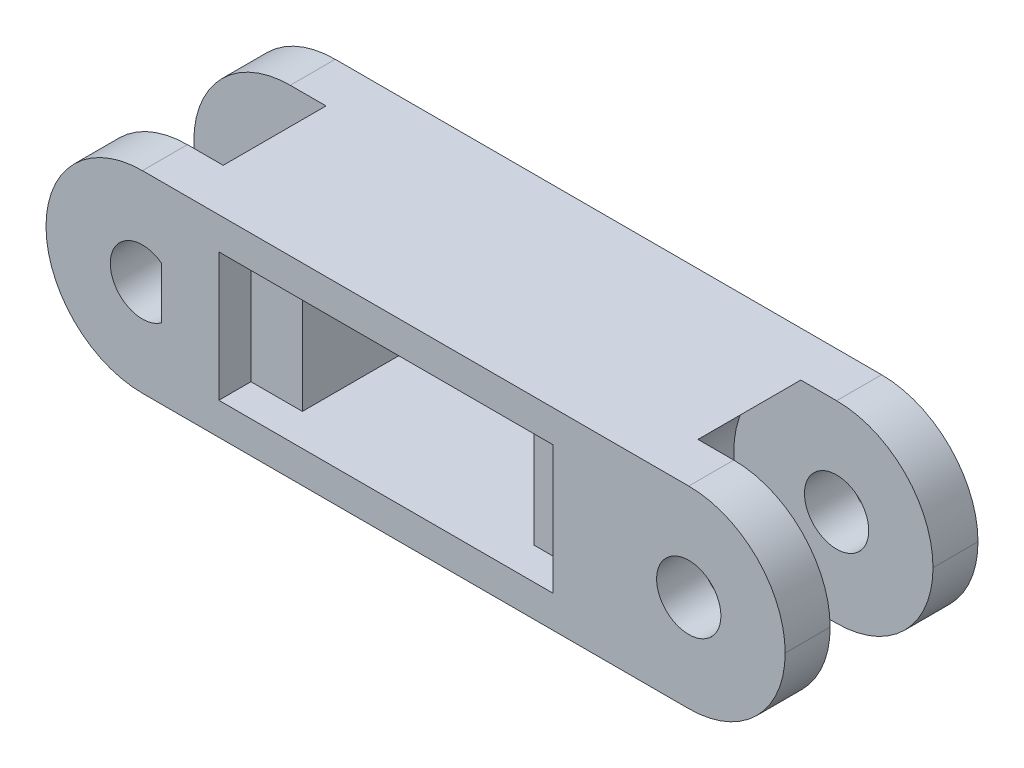
ISO-10303-21;
HEADER;
FILE_DESCRIPTION(('STEP AP214'),'2;1');
FILE_NAME('part.step','',(''),(''),'','','');
FILE_SCHEMA(('AUTOMOTIVE_DESIGN { 1 0 10303 214 1 1 1 1 }'));
ENDSEC;
DATA;
#1=APPLICATION_CONTEXT('core data for automotive mechanical design processes');
#2=APPLICATION_PROTOCOL_DEFINITION('international standard','automotive_design',2000,#1);
#3=PRODUCT_CONTEXT('',#1,'mechanical');
#4=PRODUCT('Part','Part','',(#3));
#5=PRODUCT_RELATED_PRODUCT_CATEGORY('part','',(#4));
#6=PRODUCT_DEFINITION_FORMATION('','',#4);
#7=PRODUCT_DEFINITION_CONTEXT('part definition',#1,'design');
#8=PRODUCT_DEFINITION('design','',#6,#7);
#9=PRODUCT_DEFINITION_SHAPE('','',#8);
#10=(LENGTH_UNIT() NAMED_UNIT(*) SI_UNIT(.MILLI.,.METRE.));
#11=(NAMED_UNIT(*) PLANE_ANGLE_UNIT() SI_UNIT($,.RADIAN.));
#12=(NAMED_UNIT(*) SI_UNIT($,.STERADIAN.) SOLID_ANGLE_UNIT());
#13=UNCERTAINTY_MEASURE_WITH_UNIT(LENGTH_MEASURE(1.E-05),#10,'distance_accuracy_value','');
#14=(GEOMETRIC_REPRESENTATION_CONTEXT(3) GLOBAL_UNCERTAINTY_ASSIGNED_CONTEXT((#13)) GLOBAL_UNIT_ASSIGNED_CONTEXT((#10,
#11,#12)) REPRESENTATION_CONTEXT('',''));
#15=CARTESIAN_POINT('',(0.,0.,0.));
#16=DIRECTION('',(0.,0.,1.));
#17=DIRECTION('',(1.,0.,0.));
#18=AXIS2_PLACEMENT_3D('',#15,#16,#17);
#19=CARTESIAN_POINT('',(-31.75,9.525,9.525));
#20=DIRECTION('',(0.,-1.,0.));
#21=DIRECTION('',(0.,0.,-1.));
#22=AXIS2_PLACEMENT_3D('',#19,#20,#21);
#23=PLANE('',#22);
#24=DIRECTION('',(-1.,0.,0.));
#25=VECTOR('',#24,1.);
#26=CARTESIAN_POINT('',(-31.75,9.525,-5.08));
#27=LINE('',#26,#25);
#28=CARTESIAN_POINT('',(22.225,9.525,-5.08));
#29=VERTEX_POINT('',#28);
#30=CARTESIAN_POINT('',(18.6894696296029,9.525,-5.08));
#31=VERTEX_POINT('',#30);
#32=EDGE_CURVE('E290',#29,#31,#27,.T.);
#33=ORIENTED_EDGE('',*,*,#32,.F.);
#34=DIRECTION('',(0.,0.,-1.));
#35=VECTOR('',#34,1.);
#36=CARTESIAN_POINT('',(22.225,9.525,9.525));
#37=LINE('',#36,#35);
#38=CARTESIAN_POINT('',(22.225,9.525,-9.525));
#39=VERTEX_POINT('',#38);
#40=EDGE_CURVE('E451',#29,#39,#37,.T.);
#41=ORIENTED_EDGE('',*,*,#40,.T.);
#42=DIRECTION('',(-1.,0.,0.));
#43=VECTOR('',#42,1.);
#44=CARTESIAN_POINT('',(-31.75,9.525,-9.525));
#45=LINE('',#44,#43);
#46=CARTESIAN_POINT('',(-31.75,9.525,-9.525));
#47=VERTEX_POINT('',#46);
#48=EDGE_CURVE('E420',#39,#47,#45,.T.);
#49=ORIENTED_EDGE('',*,*,#48,.T.);
#50=DIRECTION('',(0.,0.,-1.));
#51=VECTOR('',#50,1.);
#52=CARTESIAN_POINT('',(-31.75,9.525,9.525));
#53=LINE('',#52,#51);
#54=CARTESIAN_POINT('',(-31.75,9.525,-5.08));
#55=VERTEX_POINT('',#54);
#56=EDGE_CURVE('E432',#55,#47,#53,.T.);
#57=ORIENTED_EDGE('',*,*,#56,.F.);
#58=DIRECTION('',(-1.,0.,0.));
#59=VECTOR('',#58,1.);
#60=CARTESIAN_POINT('',(-31.75,9.525,-5.08));
#61=LINE('',#60,#59);
#62=CARTESIAN_POINT('',(-28.2144696296029,9.525,-5.08));
#63=VERTEX_POINT('',#62);
#64=EDGE_CURVE('E287',#63,#55,#61,.T.);
#65=ORIENTED_EDGE('',*,*,#64,.F.);
#66=DIRECTION('',(0.,0.,1.));
#67=VECTOR('',#66,1.);
#68=CARTESIAN_POINT('',(-28.2144696296029,9.525,-5.08));
#69=LINE('',#68,#67);
#70=CARTESIAN_POINT('',(-28.2144696296029,9.525,5.08));
#71=VERTEX_POINT('',#70);
#72=EDGE_CURVE('E277',#63,#71,#69,.T.);
#73=ORIENTED_EDGE('',*,*,#72,.T.);
#74=DIRECTION('',(-1.,0.,0.));
#75=VECTOR('',#74,1.);
#76=CARTESIAN_POINT('',(-31.75,9.525,5.08));
#77=LINE('',#76,#75);
#78=CARTESIAN_POINT('',(-31.75,9.525,5.08));
#79=VERTEX_POINT('',#78);
#80=EDGE_CURVE('E262',#71,#79,#77,.T.);
#81=ORIENTED_EDGE('',*,*,#80,.T.);
#82=CARTESIAN_POINT('',(-31.75,9.525,9.525));
#83=VERTEX_POINT('',#82);
#84=EDGE_CURVE('E433',#83,#79,#53,.T.);
#85=ORIENTED_EDGE('',*,*,#84,.F.);
#86=DIRECTION('',(-1.,0.,0.));
#87=VECTOR('',#86,1.);
#88=CARTESIAN_POINT('',(-31.75,9.525,9.525));
#89=LINE('',#88,#87);
#90=CARTESIAN_POINT('',(22.225,9.525,9.525));
#91=VERTEX_POINT('',#90);
#92=EDGE_CURVE('E411',#91,#83,#89,.T.);
#93=ORIENTED_EDGE('',*,*,#92,.F.);
#94=CARTESIAN_POINT('',(22.225,9.525,5.08));
#95=VERTEX_POINT('',#94);
#96=EDGE_CURVE('E452',#91,#95,#37,.T.);
#97=ORIENTED_EDGE('',*,*,#96,.T.);
#98=DIRECTION('',(-1.,0.,0.));
#99=VECTOR('',#98,1.);
#100=CARTESIAN_POINT('',(-31.75,9.525,5.08));
#101=LINE('',#100,#99);
#102=CARTESIAN_POINT('',(18.6894696296029,9.525,5.08));
#103=VERTEX_POINT('',#102);
#104=EDGE_CURVE('E491',#95,#103,#101,.T.);
#105=ORIENTED_EDGE('',*,*,#104,.T.);
#106=DIRECTION('',(0.,0.,1.));
#107=VECTOR('',#106,1.);
#108=CARTESIAN_POINT('',(18.6894696296029,9.525,-5.08));
#109=LINE('',#108,#107);
#110=EDGE_CURVE('E289',#103,#31,#109,.F.);
#111=ORIENTED_EDGE('',*,*,#110,.T.);
#112=EDGE_LOOP('',(#33,#41,#49,#57,#65,#73,#81,#85,#93,#97,#105,#111));
#113=FACE_BOUND('',#112,.T.);
#114=ADVANCED_FACE('F46',(#113),#23,.F.);
#115=CARTESIAN_POINT('',(-31.75,-9.525,9.525));
#116=DIRECTION('',(0.,1.,0.));
#117=DIRECTION('',(0.,0.,1.));
#118=AXIS2_PLACEMENT_3D('',#115,#116,#117);
#119=PLANE('',#118);
#120=DIRECTION('',(1.,0.,0.));
#121=VECTOR('',#120,1.);
#122=CARTESIAN_POINT('',(-31.75,-9.525,-5.08));
#123=LINE('',#122,#121);
#124=CARTESIAN_POINT('',(18.6894696296029,-9.525,-5.08));
#125=VERTEX_POINT('',#124);
#126=CARTESIAN_POINT('',(22.225,-9.525,-5.08));
#127=VERTEX_POINT('',#126);
#128=EDGE_CURVE('E297',#125,#127,#123,.T.);
#129=ORIENTED_EDGE('',*,*,#128,.F.);
#130=DIRECTION('',(0.,0.,1.));
#131=VECTOR('',#130,1.);
#132=CARTESIAN_POINT('',(18.6894696296029,-9.525,-5.08));
#133=LINE('',#132,#131);
#134=CARTESIAN_POINT('',(18.6894696296029,-9.525,5.08));
#135=VERTEX_POINT('',#134);
#136=EDGE_CURVE('E12',#125,#135,#133,.T.);
#137=ORIENTED_EDGE('',*,*,#136,.T.);
#138=DIRECTION('',(1.,0.,0.));
#139=VECTOR('',#138,1.);
#140=CARTESIAN_POINT('',(-31.75,-9.525,5.08));
#141=LINE('',#140,#139);
#142=CARTESIAN_POINT('',(22.225,-9.525,5.08));
#143=VERTEX_POINT('',#142);
#144=EDGE_CURVE('E520',#135,#143,#141,.T.);
#145=ORIENTED_EDGE('',*,*,#144,.T.);
#146=DIRECTION('',(0.,0.,-1.));
#147=VECTOR('',#146,1.);
#148=CARTESIAN_POINT('',(22.225,-9.525,9.525));
#149=LINE('',#148,#147);
#150=CARTESIAN_POINT('',(22.225,-9.525,9.525));
#151=VERTEX_POINT('',#150);
#152=EDGE_CURVE('E440',#143,#151,#149,.F.);
#153=ORIENTED_EDGE('',*,*,#152,.T.);
#154=DIRECTION('',(1.,0.,0.));
#155=VECTOR('',#154,1.);
#156=CARTESIAN_POINT('',(-31.75,-9.525,9.525));
#157=LINE('',#156,#155);
#158=CARTESIAN_POINT('',(-31.75,-9.525,9.525));
#159=VERTEX_POINT('',#158);
#160=EDGE_CURVE('E414',#159,#151,#157,.T.);
#161=ORIENTED_EDGE('',*,*,#160,.F.);
#162=DIRECTION('',(0.,0.,-1.));
#163=VECTOR('',#162,1.);
#164=CARTESIAN_POINT('',(-31.75,-9.525,9.525));
#165=LINE('',#164,#163);
#166=CARTESIAN_POINT('',(-31.75,-9.525,5.08));
#167=VERTEX_POINT('',#166);
#168=EDGE_CURVE('E428',#159,#167,#165,.T.);
#169=ORIENTED_EDGE('',*,*,#168,.T.);
#170=DIRECTION('',(1.,0.,0.));
#171=VECTOR('',#170,1.);
#172=CARTESIAN_POINT('',(-31.75,-9.525,5.08));
#173=LINE('',#172,#171);
#174=CARTESIAN_POINT('',(-28.2144696296029,-9.525,5.08));
#175=VERTEX_POINT('',#174);
#176=EDGE_CURVE('E73',#167,#175,#173,.T.);
#177=ORIENTED_EDGE('',*,*,#176,.T.);
#178=DIRECTION('',(0.,0.,1.));
#179=VECTOR('',#178,1.);
#180=CARTESIAN_POINT('',(-28.2144696296029,-9.525,-5.08));
#181=LINE('',#180,#179);
#182=CARTESIAN_POINT('',(-28.2144696296029,-9.525,-5.08));
#183=VERTEX_POINT('',#182);
#184=EDGE_CURVE('E55',#175,#183,#181,.F.);
#185=ORIENTED_EDGE('',*,*,#184,.T.);
#186=DIRECTION('',(1.,0.,0.));
#187=VECTOR('',#186,1.);
#188=CARTESIAN_POINT('',(-31.75,-9.525,-5.08));
#189=LINE('',#188,#187);
#190=CARTESIAN_POINT('',(-31.75,-9.525,-5.08));
#191=VERTEX_POINT('',#190);
#192=EDGE_CURVE('E499',#191,#183,#189,.T.);
#193=ORIENTED_EDGE('',*,*,#192,.F.);
#194=CARTESIAN_POINT('',(-31.75,-9.525,-9.525));
#195=VERTEX_POINT('',#194);
#196=EDGE_CURVE('E419',#191,#195,#165,.T.);
#197=ORIENTED_EDGE('',*,*,#196,.T.);
#198=DIRECTION('',(1.,0.,0.));
#199=VECTOR('',#198,1.);
#200=CARTESIAN_POINT('',(-31.75,-9.525,-9.525));
#201=LINE('',#200,#199);
#202=CARTESIAN_POINT('',(22.225,-9.525,-9.525));
#203=VERTEX_POINT('',#202);
#204=EDGE_CURVE('E415',#195,#203,#201,.T.);
#205=ORIENTED_EDGE('',*,*,#204,.T.);
#206=EDGE_CURVE('E441',#203,#127,#149,.F.);
#207=ORIENTED_EDGE('',*,*,#206,.T.);
#208=EDGE_LOOP('',(#129,#137,#145,#153,#161,#169,#177,#185,#193,#197,#205,#207));
#209=FACE_BOUND('',#208,.T.);
#210=ADVANCED_FACE('F498',(#209),#119,.F.);
#211=CARTESIAN_POINT('',(22.225,0.,9.525));
#212=DIRECTION('',(0.,0.,-1.));
#213=DIRECTION('',(-1.,0.,0.));
#214=AXIS2_PLACEMENT_3D('',#211,#212,#213);
#215=CYLINDRICAL_SURFACE('',#214,9.525);
#216=ORIENTED_EDGE('',*,*,#40,.F.);
#217=CARTESIAN_POINT('',(22.225,0.,-5.08));
#218=DIRECTION('',(0.,0.,1.));
#219=DIRECTION('',(1.,0.,0.));
#220=AXIS2_PLACEMENT_3D('',#217,#218,#219);
#221=CIRCLE('',#220,9.525);
#222=CARTESIAN_POINT('',(31.75,0.,-5.08));
#223=VERTEX_POINT('',#222);
#224=EDGE_CURVE('E528',#29,#223,#221,.F.);
#225=ORIENTED_EDGE('',*,*,#224,.T.);
#226=DIRECTION('',(0.,0.,-1.));
#227=VECTOR('',#226,1.);
#228=CARTESIAN_POINT('',(31.75,0.,9.525));
#229=LINE('',#228,#227);
#230=CARTESIAN_POINT('',(31.75,0.,-9.525));
#231=VERTEX_POINT('',#230);
#232=EDGE_CURVE('E424',#231,#223,#229,.F.);
#233=ORIENTED_EDGE('',*,*,#232,.F.);
#234=CARTESIAN_POINT('',(22.225,0.,-9.525));
#235=DIRECTION('',(0.,0.,-1.));
#236=DIRECTION('',(-1.,0.,0.));
#237=AXIS2_PLACEMENT_3D('',#234,#235,#236);
#238=CIRCLE('',#237,9.525);
#239=EDGE_CURVE('E436',#39,#231,#238,.T.);
#240=ORIENTED_EDGE('',*,*,#239,.F.);
#241=EDGE_LOOP('',(#216,#225,#233,#240));
#242=FACE_BOUND('',#241,.T.);
#243=ADVANCED_FACE('F551',(#242),#215,.T.);
#244=CARTESIAN_POINT('',(22.225,0.,9.525));
#245=DIRECTION('',(0.,0.,-1.));
#246=DIRECTION('',(-1.,0.,0.));
#247=AXIS2_PLACEMENT_3D('',#244,#245,#246);
#248=CYLINDRICAL_SURFACE('',#247,9.525);
#249=ORIENTED_EDGE('',*,*,#232,.T.);
#250=CARTESIAN_POINT('',(22.225,0.,-5.08));
#251=DIRECTION('',(0.,0.,1.));
#252=DIRECTION('',(1.,0.,0.));
#253=AXIS2_PLACEMENT_3D('',#250,#251,#252);
#254=CIRCLE('',#253,9.525);
#255=EDGE_CURVE('E490',#223,#127,#254,.F.);
#256=ORIENTED_EDGE('',*,*,#255,.T.);
#257=ORIENTED_EDGE('',*,*,#206,.F.);
#258=CARTESIAN_POINT('',(22.225,0.,-9.525));
#259=DIRECTION('',(0.,0.,-1.));
#260=DIRECTION('',(-1.,0.,0.));
#261=AXIS2_PLACEMENT_3D('',#258,#259,#260);
#262=CIRCLE('',#261,9.525);
#263=EDGE_CURVE('E438',#231,#203,#262,.T.);
#264=ORIENTED_EDGE('',*,*,#263,.F.);
#265=EDGE_LOOP('',(#249,#256,#257,#264));
#266=FACE_BOUND('',#265,.T.);
#267=ADVANCED_FACE('F537',(#266),#248,.T.);
#268=CARTESIAN_POINT('',(22.225,0.,-9.525));
#269=DIRECTION('',(0.,0.,1.));
#270=DIRECTION('',(1.,0.,0.));
#271=AXIS2_PLACEMENT_3D('',#268,#269,#270);
#272=CYLINDRICAL_SURFACE('',#271,3.175);
#273=CARTESIAN_POINT('',(22.225,0.,-9.525));
#274=DIRECTION('',(0.,0.,1.));
#275=DIRECTION('',(1.,0.,0.));
#276=AXIS2_PLACEMENT_3D('',#273,#274,#275);
#277=CIRCLE('',#276,3.175);
#278=CARTESIAN_POINT('',(25.4,0.,-9.525));
#279=VERTEX_POINT('',#278);
#280=EDGE_CURVE('E404',#279,#279,#277,.T.);
#281=CARTESIAN_POINT('',(22.225,0.,-5.08));
#282=DIRECTION('',(0.,0.,1.));
#283=DIRECTION('',(1.,0.,0.));
#284=AXIS2_PLACEMENT_3D('',#281,#282,#283);
#285=CIRCLE('',#284,3.175);
#286=CARTESIAN_POINT('',(25.4,0.,-5.08));
#287=VERTEX_POINT('',#286);
#288=EDGE_CURVE('E488',#287,#287,#285,.F.);
#289=CARTESIAN_POINT('',(25.4,0.,-9.525));
#290=CARTESIAN_POINT('',(25.4,0.,-9.47869791666667));
#291=CARTESIAN_POINT('',(25.4,0.,-9.43239583333333));
#292=CARTESIAN_POINT('',(25.4,0.,-9.33979166666667));
#293=CARTESIAN_POINT('',(25.4,0.,-9.29348958333333));
#294=CARTESIAN_POINT('',(25.4,0.,-9.20088541666667));
#295=CARTESIAN_POINT('',(25.4,0.,-9.15458333333333));
#296=CARTESIAN_POINT('',(25.4,0.,-9.06197916666667));
#297=CARTESIAN_POINT('',(25.4,0.,-9.01567708333334));
#298=CARTESIAN_POINT('',(25.4,0.,-8.92307291666667));
#299=CARTESIAN_POINT('',(25.4,0.,-8.87677083333333));
#300=CARTESIAN_POINT('',(25.4,0.,-8.78416666666667));
#301=CARTESIAN_POINT('',(25.4,0.,-8.73786458333333));
#302=CARTESIAN_POINT('',(25.4,0.,-8.64526041666667));
#303=CARTESIAN_POINT('',(25.4,0.,-8.59895833333333));
#304=CARTESIAN_POINT('',(25.4,0.,-8.50635416666667));
#305=CARTESIAN_POINT('',(25.4,0.,-8.46005208333333));
#306=CARTESIAN_POINT('',(25.4,0.,-8.36744791666667));
#307=CARTESIAN_POINT('',(25.4,0.,-8.32114583333333));
#308=CARTESIAN_POINT('',(25.4,0.,-8.22854166666667));
#309=CARTESIAN_POINT('',(25.4,0.,-8.18223958333333));
#310=CARTESIAN_POINT('',(25.4,0.,-8.08963541666667));
#311=CARTESIAN_POINT('',(25.4,0.,-8.04333333333333));
#312=CARTESIAN_POINT('',(25.4,0.,-7.95072916666667));
#313=CARTESIAN_POINT('',(25.4,0.,-7.90442708333333));
#314=CARTESIAN_POINT('',(25.4,0.,-7.81182291666667));
#315=CARTESIAN_POINT('',(25.4,0.,-7.76552083333333));
#316=CARTESIAN_POINT('',(25.4,0.,-7.67291666666667));
#317=CARTESIAN_POINT('',(25.4,0.,-7.62661458333333));
#318=CARTESIAN_POINT('',(25.4,0.,-7.53401041666667));
#319=CARTESIAN_POINT('',(25.4,0.,-7.48770833333333));
#320=CARTESIAN_POINT('',(25.4,0.,-7.39510416666667));
#321=CARTESIAN_POINT('',(25.4,0.,-7.34880208333333));
#322=CARTESIAN_POINT('',(25.4,0.,-7.25619791666667));
#323=CARTESIAN_POINT('',(25.4,0.,-7.20989583333333));
#324=CARTESIAN_POINT('',(25.4,0.,-7.11729166666667));
#325=CARTESIAN_POINT('',(25.4,0.,-7.07098958333333));
#326=CARTESIAN_POINT('',(25.4,0.,-6.97838541666667));
#327=CARTESIAN_POINT('',(25.4,0.,-6.93208333333333));
#328=CARTESIAN_POINT('',(25.4,0.,-6.83947916666667));
#329=CARTESIAN_POINT('',(25.4,0.,-6.79317708333333));
#330=CARTESIAN_POINT('',(25.4,0.,-6.70057291666667));
#331=CARTESIAN_POINT('',(25.4,0.,-6.65427083333333));
#332=CARTESIAN_POINT('',(25.4,0.,-6.56166666666667));
#333=CARTESIAN_POINT('',(25.4,0.,-6.51536458333333));
#334=CARTESIAN_POINT('',(25.4,0.,-6.42276041666667));
#335=CARTESIAN_POINT('',(25.4,0.,-6.37645833333333));
#336=CARTESIAN_POINT('',(25.4,0.,-6.28385416666667));
#337=CARTESIAN_POINT('',(25.4,0.,-6.23755208333333));
#338=CARTESIAN_POINT('',(25.4,0.,-6.14494791666667));
#339=CARTESIAN_POINT('',(25.4,0.,-6.09864583333333));
#340=CARTESIAN_POINT('',(25.4,0.,-6.00604166666667));
#341=CARTESIAN_POINT('',(25.4,0.,-5.95973958333333));
#342=CARTESIAN_POINT('',(25.4,0.,-5.86713541666667));
#343=CARTESIAN_POINT('',(25.4,0.,-5.82083333333333));
#344=CARTESIAN_POINT('',(25.4,0.,-5.72822916666667));
#345=CARTESIAN_POINT('',(25.4,0.,-5.68192708333333));
#346=CARTESIAN_POINT('',(25.4,0.,-5.58932291666667));
#347=CARTESIAN_POINT('',(25.4,0.,-5.54302083333333));
#348=CARTESIAN_POINT('',(25.4,0.,-5.45041666666667));
#349=CARTESIAN_POINT('',(25.4,0.,-5.40411458333333));
#350=CARTESIAN_POINT('',(25.4,0.,-5.31151041666667));
#351=CARTESIAN_POINT('',(25.4,0.,-5.26520833333333));
#352=CARTESIAN_POINT('',(25.4,0.,-5.17260416666667));
#353=CARTESIAN_POINT('',(25.4,0.,-5.12630208333333));
#354=CARTESIAN_POINT('',(25.4,0.,-5.08));
#355=B_SPLINE_CURVE_WITH_KNOTS('',3,(#289,#290,#291,#292,#293,#294,#295,#296,#297,#298,#299,
#300,#301,#302,#303,#304,#305,#306,#307,#308,#309,#310,#311,#312,#313,#314,#315,#316,#317,#318,
#319,#320,#321,#322,#323,#324,#325,#326,#327,#328,#329,#330,#331,#332,#333,#334,#335,#336,#337,
#338,#339,#340,#341,#342,#343,#344,#345,#346,#347,#348,#349,#350,#351,#352,#353,#354),
.UNSPECIFIED.,.F.,.F.,(4,2,2,2,2,2,2,2,2,2,2,2,2,2,2,2,2,2,2,2,2,2,2,2,2,2,2,2,2,2,2,2,4),(0.,
0.138906250000001,0.2778125,0.416718750000001,0.555625000000001,0.694531250000002,
0.833437500000001,0.972343750000002,1.11125,1.25015625,1.3890625,1.52796875,1.666875,1.80578125,
1.9446875,2.08359375,2.2225,2.36140625,2.5003125,2.63921875,2.778125,2.91703125,3.0559375,
3.19484375,3.33375,3.47265625,3.6115625,3.75046875,3.889375,4.02828125,4.1671875,4.30609375,
4.445),.UNSPECIFIED.);
#356=EDGE_CURVE('BSEAM632',#279,#287,#355,.T.);
#357=ORIENTED_EDGE('',*,*,#280,.F.);
#358=ORIENTED_EDGE('',*,*,#288,.F.);
#359=ORIENTED_EDGE('',*,*,#356,.T.);
#360=ORIENTED_EDGE('',*,*,#356,.F.);
#361=EDGE_LOOP('',(#357,#359,#358,#360));
#362=FACE_BOUND('',#361,.T.);
#363=ADVANCED_FACE('F632',(#362),#272,.F.);
#364=CARTESIAN_POINT('',(-31.75,0.,-30.8235474856855));
#365=DIRECTION('',(0.,0.,1.));
#366=DIRECTION('',(1.,0.,0.));
#367=AXIS2_PLACEMENT_3D('',#364,#365,#366);
#368=CYLINDRICAL_SURFACE('',#367,9.525);
#369=ORIENTED_EDGE('',*,*,#196,.F.);
#370=CARTESIAN_POINT('',(-31.75,0.,-5.08));
#371=DIRECTION('',(0.,0.,1.));
#372=DIRECTION('',(1.,0.,0.));
#373=AXIS2_PLACEMENT_3D('',#370,#371,#372);
#374=CIRCLE('',#373,9.525);
#375=EDGE_CURVE('E511',#191,#55,#374,.F.);
#376=ORIENTED_EDGE('',*,*,#375,.T.);
#377=ORIENTED_EDGE('',*,*,#56,.T.);
#378=CARTESIAN_POINT('',(-31.75,0.,-9.525));
#379=DIRECTION('',(0.,0.,-1.));
#380=DIRECTION('',(-1.,0.,0.));
#381=AXIS2_PLACEMENT_3D('',#378,#379,#380);
#382=CIRCLE('',#381,9.525);
#383=EDGE_CURVE('E330',#47,#195,#382,.F.);
#384=ORIENTED_EDGE('',*,*,#383,.T.);
#385=EDGE_LOOP('',(#369,#376,#377,#384));
#386=FACE_BOUND('',#385,.T.);
#387=ADVANCED_FACE('F546',(#386),#368,.T.);
#388=CARTESIAN_POINT('',(-31.75,0.,-9.525));
#389=DIRECTION('',(0.,0.,1.));
#390=DIRECTION('',(1.,0.,0.));
#391=AXIS2_PLACEMENT_3D('',#388,#389,#390);
#392=CYLINDRICAL_SURFACE('',#391,3.175);
#393=CARTESIAN_POINT('',(-31.75,0.,-5.08));
#394=DIRECTION('',(0.,0.,1.));
#395=DIRECTION('',(1.,0.,0.));
#396=AXIS2_PLACEMENT_3D('',#393,#394,#395);
#397=CIRCLE('',#396,3.175);
#398=CARTESIAN_POINT('',(-29.845,-2.54,-5.08));
#399=VERTEX_POINT('',#398);
#400=CARTESIAN_POINT('',(-29.845,2.54,-5.08));
#401=VERTEX_POINT('',#400);
#402=EDGE_CURVE('E272',#399,#401,#397,.F.);
#403=ORIENTED_EDGE('',*,*,#402,.F.);
#404=DIRECTION('',(0.,0.,1.));
#405=VECTOR('',#404,1.);
#406=CARTESIAN_POINT('',(-29.845,-2.54,-9.525));
#407=LINE('',#406,#405);
#408=CARTESIAN_POINT('',(-29.845,-2.54,-9.525));
#409=VERTEX_POINT('',#408);
#410=EDGE_CURVE('E323',#409,#399,#407,.T.);
#411=ORIENTED_EDGE('',*,*,#410,.F.);
#412=CARTESIAN_POINT('',(-31.75,0.,-9.525));
#413=DIRECTION('',(0.,0.,1.));
#414=DIRECTION('',(1.,0.,0.));
#415=AXIS2_PLACEMENT_3D('',#412,#413,#414);
#416=CIRCLE('',#415,3.175);
#417=CARTESIAN_POINT('',(-29.845,2.54,-9.525));
#418=VERTEX_POINT('',#417);
#419=EDGE_CURVE('E301',#418,#409,#416,.T.);
#420=ORIENTED_EDGE('',*,*,#419,.F.);
#421=DIRECTION('',(0.,0.,1.));
#422=VECTOR('',#421,1.);
#423=CARTESIAN_POINT('',(-29.845,2.54,-9.525));
#424=LINE('',#423,#422);
#425=EDGE_CURVE('E317',#418,#401,#424,.T.);
#426=ORIENTED_EDGE('',*,*,#425,.T.);
#427=EDGE_LOOP('',(#403,#411,#420,#426));
#428=FACE_BOUND('',#427,.T.);
#429=ADVANCED_FACE('F709',(#428),#392,.F.);
#430=CARTESIAN_POINT('',(-29.845,2.54,-9.525));
#431=DIRECTION('',(1.,0.,0.));
#432=DIRECTION('',(0.,0.,-1.));
#433=AXIS2_PLACEMENT_3D('',#430,#431,#432);
#434=PLANE('',#433);
#435=DIRECTION('',(0.,-1.,0.));
#436=VECTOR('',#435,1.);
#437=CARTESIAN_POINT('',(-29.845,2.54,-5.08));
#438=LINE('',#437,#436);
#439=EDGE_CURVE('E481',#401,#399,#438,.T.);
#440=ORIENTED_EDGE('',*,*,#439,.F.);
#441=ORIENTED_EDGE('',*,*,#425,.F.);
#442=DIRECTION('',(0.,1.,0.));
#443=VECTOR('',#442,1.);
#444=CARTESIAN_POINT('',(-29.845,2.54,-9.525));
#445=LINE('',#444,#443);
#446=EDGE_CURVE('E305',#409,#418,#445,.T.);
#447=ORIENTED_EDGE('',*,*,#446,.F.);
#448=ORIENTED_EDGE('',*,*,#410,.T.);
#449=EDGE_LOOP('',(#440,#441,#447,#448));
#450=FACE_BOUND('',#449,.T.);
#451=ADVANCED_FACE('F721',(#450),#434,.F.);
#452=CARTESIAN_POINT('',(3.73847461367321,-6.35,9.525));
#453=DIRECTION('',(1.,0.,0.));
#454=DIRECTION('',(0.,0.,-1.));
#455=AXIS2_PLACEMENT_3D('',#452,#453,#454);
#456=PLANE('',#455);
#457=DIRECTION('',(0.,-1.,0.));
#458=VECTOR('',#457,1.);
#459=CARTESIAN_POINT('',(3.73847461367321,-6.35,0.));
#460=LINE('',#459,#458);
#461=CARTESIAN_POINT('',(3.73847461367321,6.35,0.));
#462=VERTEX_POINT('',#461);
#463=CARTESIAN_POINT('',(3.73847461367321,-6.35,0.));
#464=VERTEX_POINT('',#463);
#465=EDGE_CURVE('E335',#462,#464,#460,.T.);
#466=ORIENTED_EDGE('',*,*,#465,.T.);
#467=DIRECTION('',(0.,0.,-1.));
#468=VECTOR('',#467,1.);
#469=CARTESIAN_POINT('',(3.73847461367321,-6.35,9.525));
#470=LINE('',#469,#468);
#471=CARTESIAN_POINT('',(3.73847461367321,-6.35,6.35));
#472=VERTEX_POINT('',#471);
#473=EDGE_CURVE('E368',#472,#464,#470,.T.);
#474=ORIENTED_EDGE('',*,*,#473,.F.);
#475=DIRECTION('',(0.,-1.,0.));
#476=VECTOR('',#475,1.);
#477=CARTESIAN_POINT('',(3.73847461367321,0.,6.35));
#478=LINE('',#477,#476);
#479=CARTESIAN_POINT('',(3.73847461367321,6.35,6.35));
#480=VERTEX_POINT('',#479);
#481=EDGE_CURVE('E470',#480,#472,#478,.T.);
#482=ORIENTED_EDGE('',*,*,#481,.F.);
#483=DIRECTION('',(0.,0.,-1.));
#484=VECTOR('',#483,1.);
#485=CARTESIAN_POINT('',(3.73847461367321,6.35,9.525));
#486=LINE('',#485,#484);
#487=EDGE_CURVE('E371',#480,#462,#486,.T.);
#488=ORIENTED_EDGE('',*,*,#487,.T.);
#489=EDGE_LOOP('',(#466,#474,#482,#488));
#490=FACE_BOUND('',#489,.T.);
#491=ADVANCED_FACE('F611',(#490),#456,.F.);
#492=CARTESIAN_POINT('',(0.,0.,6.35));
#493=DIRECTION('',(0.,0.,-1.));
#494=DIRECTION('',(-1.,0.,0.));
#495=AXIS2_PLACEMENT_3D('',#492,#493,#494);
#496=PLANE('',#495);
#497=DIRECTION('',(1.,0.,0.));
#498=VECTOR('',#497,1.);
#499=CARTESIAN_POINT('',(-24.2015253863268,-6.35,6.35));
#500=LINE('',#499,#498);
#501=CARTESIAN_POINT('',(-24.2015253863268,-6.35,6.35));
#502=VERTEX_POINT('',#501);
#503=CARTESIAN_POINT('',(-19.1215253863268,-6.35,6.35));
#504=VERTEX_POINT('',#503);
#505=EDGE_CURVE('E388',#502,#504,#500,.T.);
#506=ORIENTED_EDGE('',*,*,#505,.T.);
#507=DIRECTION('',(0.,1.,0.));
#508=VECTOR('',#507,1.);
#509=CARTESIAN_POINT('',(-19.1215253863268,0.,6.35));
#510=LINE('',#509,#508);
#511=CARTESIAN_POINT('',(-19.1215253863268,6.35,6.35));
#512=VERTEX_POINT('',#511);
#513=EDGE_CURVE('E473',#504,#512,#510,.T.);
#514=ORIENTED_EDGE('',*,*,#513,.T.);
#515=DIRECTION('',(-1.,0.,0.));
#516=VECTOR('',#515,1.);
#517=CARTESIAN_POINT('',(-24.2015253863268,6.35,6.35));
#518=LINE('',#517,#516);
#519=CARTESIAN_POINT('',(-24.2015253863268,6.35,6.35));
#520=VERTEX_POINT('',#519);
#521=EDGE_CURVE('E379',#512,#520,#518,.T.);
#522=ORIENTED_EDGE('',*,*,#521,.T.);
#523=DIRECTION('',(0.,-1.,0.));
#524=VECTOR('',#523,1.);
#525=CARTESIAN_POINT('',(-24.2015253863268,-6.35,6.35));
#526=LINE('',#525,#524);
#527=EDGE_CURVE('E383',#520,#502,#526,.T.);
#528=ORIENTED_EDGE('',*,*,#527,.T.);
#529=EDGE_LOOP('',(#506,#514,#522,#528));
#530=FACE_BOUND('',#529,.T.);
#531=ADVANCED_FACE('F575',(#530),#496,.F.);
#532=CARTESIAN_POINT('',(0.,0.,9.525));
#533=DIRECTION('',(0.,0.,-1.));
#534=DIRECTION('',(-1.,0.,0.));
#535=AXIS2_PLACEMENT_3D('',#532,#533,#534);
#536=PLANE('',#535);
#537=DIRECTION('',(0.,1.,0.));
#538=VECTOR('',#537,1.);
#539=CARTESIAN_POINT('',(-29.845,2.54,9.525));
#540=LINE('',#539,#538);
#541=CARTESIAN_POINT('',(-29.845,-2.54,9.525));
#542=VERTEX_POINT('',#541);
#543=CARTESIAN_POINT('',(-29.845,2.54,9.525));
#544=VERTEX_POINT('',#543);
#545=EDGE_CURVE('E306',#542,#544,#540,.T.);
#546=ORIENTED_EDGE('',*,*,#545,.F.);
#547=CARTESIAN_POINT('',(-31.75,0.,9.525));
#548=DIRECTION('',(0.,0.,1.));
#549=DIRECTION('',(1.,0.,0.));
#550=AXIS2_PLACEMENT_3D('',#547,#548,#549);
#551=CIRCLE('',#550,3.175);
#552=EDGE_CURVE('E295',#544,#542,#551,.T.);
#553=ORIENTED_EDGE('',*,*,#552,.F.);
#554=EDGE_LOOP('',(#546,#553));
#555=FACE_BOUND('',#554,.T.);
#556=ORIENTED_EDGE('',*,*,#160,.T.);
#557=CARTESIAN_POINT('',(22.225,0.,9.525));
#558=DIRECTION('',(0.,0.,-1.));
#559=DIRECTION('',(-1.,0.,0.));
#560=AXIS2_PLACEMENT_3D('',#557,#558,#559);
#561=CIRCLE('',#560,9.525);
#562=CARTESIAN_POINT('',(31.75,0.,9.525));
#563=VERTEX_POINT('',#562);
#564=EDGE_CURVE('E447',#151,#563,#561,.F.);
#565=ORIENTED_EDGE('',*,*,#564,.T.);
#566=CARTESIAN_POINT('',(22.225,0.,9.525));
#567=DIRECTION('',(0.,0.,-1.));
#568=DIRECTION('',(-1.,0.,0.));
#569=AXIS2_PLACEMENT_3D('',#566,#567,#568);
#570=CIRCLE('',#569,9.525);
#571=EDGE_CURVE('E444',#563,#91,#570,.F.);
#572=ORIENTED_EDGE('',*,*,#571,.T.);
#573=ORIENTED_EDGE('',*,*,#92,.T.);
#574=CARTESIAN_POINT('',(-31.75,0.,9.525));
#575=DIRECTION('',(0.,0.,1.));
#576=DIRECTION('',(1.,0.,0.));
#577=AXIS2_PLACEMENT_3D('',#574,#575,#576);
#578=CIRCLE('',#577,9.525);
#579=EDGE_CURVE('E321',#83,#159,#578,.T.);
#580=ORIENTED_EDGE('',*,*,#579,.T.);
#581=EDGE_LOOP('',(#556,#565,#572,#573,#580));
#582=FACE_BOUND('',#581,.T.);
#583=CARTESIAN_POINT('',(22.225,0.,9.525));
#584=DIRECTION('',(0.,0.,-1.));
#585=DIRECTION('',(-1.,0.,0.));
#586=AXIS2_PLACEMENT_3D('',#583,#584,#585);
#587=CIRCLE('',#586,3.175);
#588=CARTESIAN_POINT('',(25.4,0.,9.525));
#589=VERTEX_POINT('',#588);
#590=EDGE_CURVE('E407',#589,#589,#587,.T.);
#591=ORIENTED_EDGE('',*,*,#590,.T.);
#592=EDGE_LOOP('',(#591));
#593=FACE_BOUND('',#592,.T.);
#594=DIRECTION('',(0.,1.,0.));
#595=VECTOR('',#594,1.);
#596=CARTESIAN_POINT('',(8.81847461367321,0.,9.525));
#597=LINE('',#596,#595);
#598=CARTESIAN_POINT('',(8.81847461367321,-6.35,9.525));
#599=VERTEX_POINT('',#598);
#600=CARTESIAN_POINT('',(8.81847461367321,6.35,9.525));
#601=VERTEX_POINT('',#600);
#602=EDGE_CURVE('E467',#599,#601,#597,.T.);
#603=ORIENTED_EDGE('',*,*,#602,.F.);
#604=DIRECTION('',(1.,0.,0.));
#605=VECTOR('',#604,1.);
#606=CARTESIAN_POINT('',(0.,-6.35,9.525));
#607=LINE('',#606,#605);
#608=CARTESIAN_POINT('',(-24.2015253863268,-6.35,9.525));
#609=VERTEX_POINT('',#608);
#610=EDGE_CURVE('E455',#609,#599,#607,.T.);
#611=ORIENTED_EDGE('',*,*,#610,.F.);
#612=DIRECTION('',(0.,-1.,0.));
#613=VECTOR('',#612,1.);
#614=CARTESIAN_POINT('',(-24.2015253863268,0.,9.525));
#615=LINE('',#614,#613);
#616=CARTESIAN_POINT('',(-24.2015253863268,6.35,9.525));
#617=VERTEX_POINT('',#616);
#618=EDGE_CURVE('E460',#617,#609,#615,.T.);
#619=ORIENTED_EDGE('',*,*,#618,.F.);
#620=DIRECTION('',(-1.,0.,0.));
#621=VECTOR('',#620,1.);
#622=CARTESIAN_POINT('',(0.,6.35,9.525));
#623=LINE('',#622,#621);
#624=EDGE_CURVE('E464',#601,#617,#623,.T.);
#625=ORIENTED_EDGE('',*,*,#624,.F.);
#626=EDGE_LOOP('',(#603,#611,#619,#625));
#627=FACE_BOUND('',#626,.T.);
#628=ADVANCED_FACE('F618',(#555,#582,#593,#627),#536,.F.);
#629=CARTESIAN_POINT('',(0.,0.,-9.525));
#630=DIRECTION('',(0.,0.,-1.));
#631=DIRECTION('',(-1.,0.,0.));
#632=AXIS2_PLACEMENT_3D('',#629,#630,#631);
#633=PLANE('',#632);
#634=ORIENTED_EDGE('',*,*,#419,.T.);
#635=ORIENTED_EDGE('',*,*,#446,.T.);
#636=EDGE_LOOP('',(#634,#635));
#637=FACE_BOUND('',#636,.T.);
#638=DIRECTION('',(0.,-1.,0.));
#639=VECTOR('',#638,1.);
#640=CARTESIAN_POINT('',(8.81847461367321,6.35,-9.525));
#641=LINE('',#640,#639);
#642=CARTESIAN_POINT('',(8.81847461367321,6.35,-9.525));
#643=VERTEX_POINT('',#642);
#644=CARTESIAN_POINT('',(8.81847461367321,-6.35,-9.525));
#645=VERTEX_POINT('',#644);
#646=EDGE_CURVE('E334',#643,#645,#641,.T.);
#647=ORIENTED_EDGE('',*,*,#646,.F.);
#648=DIRECTION('',(1.,0.,0.));
#649=VECTOR('',#648,1.);
#650=CARTESIAN_POINT('',(3.73847461367321,6.35,-9.525));
#651=LINE('',#650,#649);
#652=CARTESIAN_POINT('',(-19.1215253863268,6.35,-9.525));
#653=VERTEX_POINT('',#652);
#654=EDGE_CURVE('E357',#653,#643,#651,.T.);
#655=ORIENTED_EDGE('',*,*,#654,.F.);
#656=DIRECTION('',(0.,1.,0.));
#657=VECTOR('',#656,1.);
#658=CARTESIAN_POINT('',(-19.1215253863268,-6.35,-9.525));
#659=LINE('',#658,#657);
#660=CARTESIAN_POINT('',(-19.1215253863268,-6.35,-9.525));
#661=VERTEX_POINT('',#660);
#662=EDGE_CURVE('E354',#661,#653,#659,.T.);
#663=ORIENTED_EDGE('',*,*,#662,.F.);
#664=DIRECTION('',(-1.,0.,0.));
#665=VECTOR('',#664,1.);
#666=CARTESIAN_POINT('',(3.73847461367321,-6.35,-9.525));
#667=LINE('',#666,#665);
#668=EDGE_CURVE('E359',#645,#661,#667,.T.);
#669=ORIENTED_EDGE('',*,*,#668,.F.);
#670=EDGE_LOOP('',(#647,#655,#663,#669));
#671=FACE_BOUND('',#670,.T.);
#672=ORIENTED_EDGE('',*,*,#280,.T.);
#673=EDGE_LOOP('',(#672));
#674=FACE_BOUND('',#673,.T.);
#675=ORIENTED_EDGE('',*,*,#239,.T.);
#676=ORIENTED_EDGE('',*,*,#263,.T.);
#677=ORIENTED_EDGE('',*,*,#204,.F.);
#678=ORIENTED_EDGE('',*,*,#383,.F.);
#679=ORIENTED_EDGE('',*,*,#48,.F.);
#680=EDGE_LOOP('',(#675,#676,#677,#678,#679));
#681=FACE_BOUND('',#680,.T.);
#682=ADVANCED_FACE('F543',(#637,#671,#674,#681),#633,.T.);
#683=CARTESIAN_POINT('',(22.225,0.,5.08));
#684=DIRECTION('',(0.,0.,1.));
#685=DIRECTION('',(1.,0.,0.));
#686=AXIS2_PLACEMENT_3D('',#683,#684,#685);
#687=CIRCLE('',#686,9.525);
#688=CARTESIAN_POINT('',(31.75,0.,5.08));
#689=VERTEX_POINT('',#688);
#690=EDGE_CURVE('E62',#95,#689,#687,.F.);
#691=ORIENTED_EDGE('',*,*,#690,.F.);
#692=ORIENTED_EDGE('',*,*,#96,.F.);
#693=ORIENTED_EDGE('',*,*,#571,.F.);
#694=EDGE_CURVE('E410',#689,#563,#229,.F.);
#695=ORIENTED_EDGE('',*,*,#694,.F.);
#696=EDGE_LOOP('',(#691,#692,#693,#695));
#697=FACE_BOUND('',#696,.T.);
#698=ADVANCED_FACE('F48',(#697),#215,.T.);
#699=CARTESIAN_POINT('',(22.225,0.,5.08));
#700=DIRECTION('',(0.,0.,1.));
#701=DIRECTION('',(1.,0.,0.));
#702=AXIS2_PLACEMENT_3D('',#699,#700,#701);
#703=CIRCLE('',#702,9.525);
#704=EDGE_CURVE('E487',#689,#143,#703,.F.);
#705=ORIENTED_EDGE('',*,*,#704,.F.);
#706=ORIENTED_EDGE('',*,*,#694,.T.);
#707=ORIENTED_EDGE('',*,*,#564,.F.);
#708=ORIENTED_EDGE('',*,*,#152,.F.);
#709=EDGE_LOOP('',(#705,#706,#707,#708));
#710=FACE_BOUND('',#709,.T.);
#711=ADVANCED_FACE('F629',(#710),#248,.T.);
#712=CARTESIAN_POINT('',(22.225,0.,5.08));
#713=DIRECTION('',(0.,0.,1.));
#714=DIRECTION('',(1.,0.,0.));
#715=AXIS2_PLACEMENT_3D('',#712,#713,#714);
#716=CIRCLE('',#715,3.175);
#717=CARTESIAN_POINT('',(25.4,0.,5.08));
#718=VERTEX_POINT('',#717);
#719=EDGE_CURVE('E484',#718,#718,#716,.F.);
#720=CARTESIAN_POINT('',(25.4,0.,5.08));
#721=CARTESIAN_POINT('',(25.4,0.,5.12630208333333));
#722=CARTESIAN_POINT('',(25.4,0.,5.17260416666667));
#723=CARTESIAN_POINT('',(25.4,0.,5.26520833333333));
#724=CARTESIAN_POINT('',(25.4,0.,5.31151041666666));
#725=CARTESIAN_POINT('',(25.4,0.,5.40411458333333));
#726=CARTESIAN_POINT('',(25.4,0.,5.45041666666666));
#727=CARTESIAN_POINT('',(25.4,0.,5.54302083333333));
#728=CARTESIAN_POINT('',(25.4,0.,5.58932291666666));
#729=CARTESIAN_POINT('',(25.4,0.,5.68192708333333));
#730=CARTESIAN_POINT('',(25.4,0.,5.72822916666667));
#731=CARTESIAN_POINT('',(25.4,0.,5.82083333333333));
#732=CARTESIAN_POINT('',(25.4,0.,5.86713541666667));
#733=CARTESIAN_POINT('',(25.4,0.,5.95973958333333));
#734=CARTESIAN_POINT('',(25.4,0.,6.00604166666666));
#735=CARTESIAN_POINT('',(25.4,0.,6.09864583333333));
#736=CARTESIAN_POINT('',(25.4,0.,6.14494791666666));
#737=CARTESIAN_POINT('',(25.4,0.,6.23755208333333));
#738=CARTESIAN_POINT('',(25.4,0.,6.28385416666666));
#739=CARTESIAN_POINT('',(25.4,0.,6.37645833333333));
#740=CARTESIAN_POINT('',(25.4,0.,6.42276041666666));
#741=CARTESIAN_POINT('',(25.4,0.,6.51536458333333));
#742=CARTESIAN_POINT('',(25.4,0.,6.56166666666666));
#743=CARTESIAN_POINT('',(25.4,0.,6.65427083333333));
#744=CARTESIAN_POINT('',(25.4,0.,6.70057291666666));
#745=CARTESIAN_POINT('',(25.4,0.,6.79317708333333));
#746=CARTESIAN_POINT('',(25.4,0.,6.83947916666666));
#747=CARTESIAN_POINT('',(25.4,0.,6.93208333333333));
#748=CARTESIAN_POINT('',(25.4,0.,6.97838541666666));
#749=CARTESIAN_POINT('',(25.4,0.,7.07098958333333));
#750=CARTESIAN_POINT('',(25.4,0.,7.11729166666666));
#751=CARTESIAN_POINT('',(25.4,0.,7.20989583333333));
#752=CARTESIAN_POINT('',(25.4,0.,7.25619791666666));
#753=CARTESIAN_POINT('',(25.4,0.,7.34880208333333));
#754=CARTESIAN_POINT('',(25.4,0.,7.39510416666667));
#755=CARTESIAN_POINT('',(25.4,0.,7.48770833333333));
#756=CARTESIAN_POINT('',(25.4,0.,7.53401041666667));
#757=CARTESIAN_POINT('',(25.4,0.,7.62661458333333));
#758=CARTESIAN_POINT('',(25.4,0.,7.67291666666667));
#759=CARTESIAN_POINT('',(25.4,0.,7.76552083333333));
#760=CARTESIAN_POINT('',(25.4,0.,7.81182291666666));
#761=CARTESIAN_POINT('',(25.4,0.,7.90442708333333));
#762=CARTESIAN_POINT('',(25.4,0.,7.95072916666667));
#763=CARTESIAN_POINT('',(25.4,0.,8.04333333333333));
#764=CARTESIAN_POINT('',(25.4,0.,8.08963541666667));
#765=CARTESIAN_POINT('',(25.4,0.,8.18223958333333));
#766=CARTESIAN_POINT('',(25.4,0.,8.22854166666666));
#767=CARTESIAN_POINT('',(25.4,0.,8.32114583333333));
#768=CARTESIAN_POINT('',(25.4,0.,8.36744791666667));
#769=CARTESIAN_POINT('',(25.4,0.,8.46005208333333));
#770=CARTESIAN_POINT('',(25.4,0.,8.50635416666667));
#771=CARTESIAN_POINT('',(25.4,0.,8.59895833333333));
#772=CARTESIAN_POINT('',(25.4,0.,8.64526041666667));
#773=CARTESIAN_POINT('',(25.4,0.,8.73786458333333));
#774=CARTESIAN_POINT('',(25.4,0.,8.78416666666667));
#775=CARTESIAN_POINT('',(25.4,0.,8.87677083333333));
#776=CARTESIAN_POINT('',(25.4,0.,8.92307291666667));
#777=CARTESIAN_POINT('',(25.4,0.,9.01567708333333));
#778=CARTESIAN_POINT('',(25.4,0.,9.06197916666667));
#779=CARTESIAN_POINT('',(25.4,0.,9.15458333333333));
#780=CARTESIAN_POINT('',(25.4,0.,9.20088541666667));
#781=CARTESIAN_POINT('',(25.4,0.,9.29348958333333));
#782=CARTESIAN_POINT('',(25.4,0.,9.33979166666667));
#783=CARTESIAN_POINT('',(25.4,0.,9.43239583333333));
#784=CARTESIAN_POINT('',(25.4,0.,9.47869791666667));
#785=CARTESIAN_POINT('',(25.4,0.,9.525));
#786=B_SPLINE_CURVE_WITH_KNOTS('',3,(#720,#721,#722,#723,#724,#725,#726,#727,#728,#729,#730,
#731,#732,#733,#734,#735,#736,#737,#738,#739,#740,#741,#742,#743,#744,#745,#746,#747,#748,#749,
#750,#751,#752,#753,#754,#755,#756,#757,#758,#759,#760,#761,#762,#763,#764,#765,#766,#767,#768,
#769,#770,#771,#772,#773,#774,#775,#776,#777,#778,#779,#780,#781,#782,#783,#784,#785),
.UNSPECIFIED.,.F.,.F.,(4,2,2,2,2,2,2,2,2,2,2,2,2,2,2,2,2,2,2,2,2,2,2,2,2,2,2,2,2,2,2,2,4),(0.,
0.138906250000001,0.2778125,0.41671875,0.555625000000001,0.694531250000002,0.833437500000001,
0.97234375,1.11125,1.25015625,1.3890625,1.52796875,1.666875,1.80578125,1.9446875,2.08359375,
2.2225,2.36140625,2.5003125,2.63921875,2.778125,2.91703125,3.0559375,3.19484375,3.33375,
3.47265625,3.6115625,3.75046875,3.889375,4.02828125,4.1671875,4.30609375,4.445),.UNSPECIFIED.);
#787=EDGE_CURVE('BSEAM621',#718,#589,#786,.T.);
#788=ORIENTED_EDGE('',*,*,#719,.T.);
#789=ORIENTED_EDGE('',*,*,#590,.F.);
#790=ORIENTED_EDGE('',*,*,#787,.T.);
#791=ORIENTED_EDGE('',*,*,#787,.F.);
#792=EDGE_LOOP('',(#788,#790,#789,#791));
#793=FACE_BOUND('',#792,.T.);
#794=ADVANCED_FACE('F621',(#793),#272,.F.);
#795=CARTESIAN_POINT('',(8.81847461367321,-6.35,9.525012));
#796=DIRECTION('',(-1.,0.,0.));
#797=DIRECTION('',(0.,0.,1.));
#798=AXIS2_PLACEMENT_3D('',#795,#796,#797);
#799=PLANE('',#798);
#800=ORIENTED_EDGE('',*,*,#602,.T.);
#801=DIRECTION('',(0.,0.,-1.));
#802=VECTOR('',#801,1.);
#803=CARTESIAN_POINT('',(8.81847461367321,6.35,9.525012));
#804=LINE('',#803,#802);
#805=CARTESIAN_POINT('',(8.81847461367321,6.35,6.35));
#806=VERTEX_POINT('',#805);
#807=EDGE_CURVE('E402',#601,#806,#804,.T.);
#808=ORIENTED_EDGE('',*,*,#807,.T.);
#809=DIRECTION('',(0.,1.,0.));
#810=VECTOR('',#809,1.);
#811=CARTESIAN_POINT('',(8.81847461367321,-6.35,6.35));
#812=LINE('',#811,#810);
#813=CARTESIAN_POINT('',(8.81847461367321,-6.35,6.35));
#814=VERTEX_POINT('',#813);
#815=EDGE_CURVE('E367',#814,#806,#812,.T.);
#816=ORIENTED_EDGE('',*,*,#815,.F.);
#817=DIRECTION('',(0.,0.,-1.));
#818=VECTOR('',#817,1.);
#819=CARTESIAN_POINT('',(8.81847461367321,-6.35,9.525012));
#820=LINE('',#819,#818);
#821=EDGE_CURVE('E392',#599,#814,#820,.T.);
#822=ORIENTED_EDGE('',*,*,#821,.F.);
#823=EDGE_LOOP('',(#800,#808,#816,#822));
#824=FACE_BOUND('',#823,.T.);
#825=ADVANCED_FACE('F619',(#824),#799,.T.);
#826=CARTESIAN_POINT('',(-24.2015253863268,6.35,9.525012));
#827=DIRECTION('',(0.,-1.,0.));
#828=DIRECTION('',(1.,0.,0.));
#829=AXIS2_PLACEMENT_3D('',#826,#827,#828);
#830=PLANE('',#829);
#831=ORIENTED_EDGE('',*,*,#624,.T.);
#832=DIRECTION('',(0.,0.,-1.));
#833=VECTOR('',#832,1.);
#834=CARTESIAN_POINT('',(-24.2015253863268,6.35,9.525012));
#835=LINE('',#834,#833);
#836=EDGE_CURVE('E399',#617,#520,#835,.T.);
#837=ORIENTED_EDGE('',*,*,#836,.T.);
#838=ORIENTED_EDGE('',*,*,#521,.F.);
#839=DIRECTION('',(0.,0.,-1.));
#840=VECTOR('',#839,1.);
#841=CARTESIAN_POINT('',(-19.1215253863268,6.35,9.525));
#842=LINE('',#841,#840);
#843=EDGE_CURVE('E363',#512,#653,#842,.T.);
#844=ORIENTED_EDGE('',*,*,#843,.T.);
#845=ORIENTED_EDGE('',*,*,#654,.T.);
#846=DIRECTION('',(0.,0.,-1.));
#847=VECTOR('',#846,1.);
#848=CARTESIAN_POINT('',(8.81847461367321,6.35,20.0283186101216));
#849=LINE('',#848,#847);
#850=CARTESIAN_POINT('',(8.81847461367321,6.35,0.));
#851=VERTEX_POINT('',#850);
#852=EDGE_CURVE('E339',#851,#643,#849,.T.);
#853=ORIENTED_EDGE('',*,*,#852,.F.);
#854=DIRECTION('',(-1.,0.,0.));
#855=VECTOR('',#854,1.);
#856=CARTESIAN_POINT('',(3.73847461367321,6.35,0.));
#857=LINE('',#856,#855);
#858=EDGE_CURVE('E338',#851,#462,#857,.T.);
#859=ORIENTED_EDGE('',*,*,#858,.T.);
#860=ORIENTED_EDGE('',*,*,#487,.F.);
#861=EDGE_CURVE('E380',#806,#480,#518,.T.);
#862=ORIENTED_EDGE('',*,*,#861,.F.);
#863=ORIENTED_EDGE('',*,*,#807,.F.);
#864=EDGE_LOOP('',(#831,#837,#838,#844,#845,#853,#859,#860,#862,#863));
#865=FACE_BOUND('',#864,.T.);
#866=ADVANCED_FACE('F580',(#865),#830,.T.);
#867=CARTESIAN_POINT('',(-24.2015253863268,-6.35,9.525012));
#868=DIRECTION('',(1.,0.,0.));
#869=DIRECTION('',(0.,0.,-1.));
#870=AXIS2_PLACEMENT_3D('',#867,#868,#869);
#871=PLANE('',#870);
#872=ORIENTED_EDGE('',*,*,#618,.T.);
#873=DIRECTION('',(0.,0.,-1.));
#874=VECTOR('',#873,1.);
#875=CARTESIAN_POINT('',(-24.2015253863268,-6.35,9.525012));
#876=LINE('',#875,#874);
#877=EDGE_CURVE('E396',#609,#502,#876,.T.);
#878=ORIENTED_EDGE('',*,*,#877,.T.);
#879=ORIENTED_EDGE('',*,*,#527,.F.);
#880=ORIENTED_EDGE('',*,*,#836,.F.);
#881=EDGE_LOOP('',(#872,#878,#879,#880));
#882=FACE_BOUND('',#881,.T.);
#883=ADVANCED_FACE('F585',(#882),#871,.T.);
#884=CARTESIAN_POINT('',(-24.2015253863268,-6.35,9.525012));
#885=DIRECTION('',(0.,1.,0.));
#886=DIRECTION('',(-1.,0.,0.));
#887=AXIS2_PLACEMENT_3D('',#884,#885,#886);
#888=PLANE('',#887);
#889=EDGE_CURVE('E387',#472,#814,#500,.T.);
#890=ORIENTED_EDGE('',*,*,#889,.F.);
#891=ORIENTED_EDGE('',*,*,#473,.T.);
#892=DIRECTION('',(1.,0.,0.));
#893=VECTOR('',#892,1.);
#894=CARTESIAN_POINT('',(8.81847461367321,-6.35,0.));
#895=LINE('',#894,#893);
#896=CARTESIAN_POINT('',(8.81847461367321,-6.35,0.));
#897=VERTEX_POINT('',#896);
#898=EDGE_CURVE('E343',#464,#897,#895,.T.);
#899=ORIENTED_EDGE('',*,*,#898,.T.);
#900=DIRECTION('',(0.,0.,-1.));
#901=VECTOR('',#900,1.);
#902=CARTESIAN_POINT('',(8.81847461367321,-6.35,20.0283186101216));
#903=LINE('',#902,#901);
#904=EDGE_CURVE('E347',#897,#645,#903,.T.);
#905=ORIENTED_EDGE('',*,*,#904,.T.);
#906=ORIENTED_EDGE('',*,*,#668,.T.);
#907=DIRECTION('',(0.,0.,-1.));
#908=VECTOR('',#907,1.);
#909=CARTESIAN_POINT('',(-19.1215253863268,-6.35,9.525));
#910=LINE('',#909,#908);
#911=EDGE_CURVE('E364',#504,#661,#910,.T.);
#912=ORIENTED_EDGE('',*,*,#911,.F.);
#913=ORIENTED_EDGE('',*,*,#505,.F.);
#914=ORIENTED_EDGE('',*,*,#877,.F.);
#915=ORIENTED_EDGE('',*,*,#610,.T.);
#916=ORIENTED_EDGE('',*,*,#821,.T.);
#917=EDGE_LOOP('',(#890,#891,#899,#905,#906,#912,#913,#914,#915,#916));
#918=FACE_BOUND('',#917,.T.);
#919=ADVANCED_FACE('F589',(#918),#888,.T.);
#920=ORIENTED_EDGE('',*,*,#861,.T.);
#921=ORIENTED_EDGE('',*,*,#481,.T.);
#922=ORIENTED_EDGE('',*,*,#889,.T.);
#923=ORIENTED_EDGE('',*,*,#815,.T.);
#924=EDGE_LOOP('',(#920,#921,#922,#923));
#925=FACE_BOUND('',#924,.T.);
#926=ADVANCED_FACE('F613',(#925),#496,.F.);
#927=CARTESIAN_POINT('',(-19.1215253863268,-6.35,9.525));
#928=DIRECTION('',(-1.,0.,0.));
#929=DIRECTION('',(0.,0.,1.));
#930=AXIS2_PLACEMENT_3D('',#927,#928,#929);
#931=PLANE('',#930);
#932=ORIENTED_EDGE('',*,*,#911,.T.);
#933=ORIENTED_EDGE('',*,*,#662,.T.);
#934=ORIENTED_EDGE('',*,*,#843,.F.);
#935=ORIENTED_EDGE('',*,*,#513,.F.);
#936=EDGE_LOOP('',(#932,#933,#934,#935));
#937=FACE_BOUND('',#936,.T.);
#938=ADVANCED_FACE('F594',(#937),#931,.F.);
#939=CARTESIAN_POINT('',(8.81847461367321,6.35,20.0283186101216));
#940=DIRECTION('',(1.,0.,0.));
#941=DIRECTION('',(0.,0.,-1.));
#942=AXIS2_PLACEMENT_3D('',#939,#940,#941);
#943=PLANE('',#942);
#944=DIRECTION('',(0.,1.,0.));
#945=VECTOR('',#944,1.);
#946=CARTESIAN_POINT('',(8.81847461367321,6.35,0.));
#947=LINE('',#946,#945);
#948=EDGE_CURVE('E341',#897,#851,#947,.T.);
#949=ORIENTED_EDGE('',*,*,#948,.T.);
#950=ORIENTED_EDGE('',*,*,#852,.T.);
#951=ORIENTED_EDGE('',*,*,#646,.T.);
#952=ORIENTED_EDGE('',*,*,#904,.F.);
#953=EDGE_LOOP('',(#949,#950,#951,#952));
#954=FACE_BOUND('',#953,.T.);
#955=ADVANCED_FACE('F602',(#954),#943,.F.);
#956=CARTESIAN_POINT('',(0.,0.,0.));
#957=DIRECTION('',(0.,0.,-1.));
#958=DIRECTION('',(-1.,0.,0.));
#959=AXIS2_PLACEMENT_3D('',#956,#957,#958);
#960=PLANE('',#959);
#961=ORIENTED_EDGE('',*,*,#948,.F.);
#962=ORIENTED_EDGE('',*,*,#898,.F.);
#963=ORIENTED_EDGE('',*,*,#465,.F.);
#964=ORIENTED_EDGE('',*,*,#858,.F.);
#965=EDGE_LOOP('',(#961,#962,#963,#964));
#966=FACE_BOUND('',#965,.T.);
#967=ADVANCED_FACE('F609',(#966),#960,.T.);
#968=CARTESIAN_POINT('',(-31.75,0.,5.08));
#969=DIRECTION('',(0.,0.,1.));
#970=DIRECTION('',(1.,0.,0.));
#971=AXIS2_PLACEMENT_3D('',#968,#969,#970);
#972=CIRCLE('',#971,9.525);
#973=EDGE_CURVE('E266',#167,#79,#972,.F.);
#974=ORIENTED_EDGE('',*,*,#973,.F.);
#975=ORIENTED_EDGE('',*,*,#168,.F.);
#976=ORIENTED_EDGE('',*,*,#579,.F.);
#977=ORIENTED_EDGE('',*,*,#84,.T.);
#978=EDGE_LOOP('',(#974,#975,#976,#977));
#979=FACE_BOUND('',#978,.T.);
#980=ADVANCED_FACE('F711',(#979),#368,.T.);
#981=CARTESIAN_POINT('',(-29.845,-2.54,5.08));
#982=VERTEX_POINT('',#981);
#983=EDGE_CURVE('E310',#982,#542,#407,.T.);
#984=ORIENTED_EDGE('',*,*,#983,.F.);
#985=CARTESIAN_POINT('',(-31.75,0.,5.08));
#986=DIRECTION('',(0.,0.,1.));
#987=DIRECTION('',(1.,0.,0.));
#988=AXIS2_PLACEMENT_3D('',#985,#986,#987);
#989=CIRCLE('',#988,3.175);
#990=CARTESIAN_POINT('',(-29.845,2.54,5.08));
#991=VERTEX_POINT('',#990);
#992=EDGE_CURVE('E506',#982,#991,#989,.F.);
#993=ORIENTED_EDGE('',*,*,#992,.T.);
#994=EDGE_CURVE('E322',#991,#544,#424,.T.);
#995=ORIENTED_EDGE('',*,*,#994,.T.);
#996=ORIENTED_EDGE('',*,*,#552,.T.);
#997=EDGE_LOOP('',(#984,#993,#995,#996));
#998=FACE_BOUND('',#997,.T.);
#999=ADVANCED_FACE('F565',(#998),#392,.F.);
#1000=ORIENTED_EDGE('',*,*,#994,.F.);
#1001=DIRECTION('',(0.,-1.,0.));
#1002=VECTOR('',#1001,1.);
#1003=CARTESIAN_POINT('',(-29.845,2.54,5.08));
#1004=LINE('',#1003,#1002);
#1005=EDGE_CURVE('E477',#991,#982,#1004,.T.);
#1006=ORIENTED_EDGE('',*,*,#1005,.T.);
#1007=ORIENTED_EDGE('',*,*,#983,.T.);
#1008=ORIENTED_EDGE('',*,*,#545,.T.);
#1009=EDGE_LOOP('',(#1000,#1006,#1007,#1008));
#1010=FACE_BOUND('',#1009,.T.);
#1011=ADVANCED_FACE('F568',(#1010),#434,.F.);
#1012=CARTESIAN_POINT('',(-31.75,0.,-5.08));
#1013=DIRECTION('',(0.,0.,1.));
#1014=DIRECTION('',(1.,0.,0.));
#1015=AXIS2_PLACEMENT_3D('',#1012,#1013,#1014);
#1016=CYLINDRICAL_SURFACE('',#1015,10.16);
#1017=CARTESIAN_POINT('',(-31.75,0.,-5.08));
#1018=DIRECTION('',(0.,0.,1.));
#1019=DIRECTION('',(1.,0.,0.));
#1020=AXIS2_PLACEMENT_3D('',#1017,#1018,#1019);
#1021=CIRCLE('',#1020,10.16);
#1022=EDGE_CURVE('E282',#183,#63,#1021,.T.);
#1023=ORIENTED_EDGE('',*,*,#1022,.F.);
#1024=ORIENTED_EDGE('',*,*,#184,.F.);
#1025=CARTESIAN_POINT('',(-31.75,0.,5.08));
#1026=DIRECTION('',(0.,0.,1.));
#1027=DIRECTION('',(1.,0.,0.));
#1028=AXIS2_PLACEMENT_3D('',#1025,#1026,#1027);
#1029=CIRCLE('',#1028,10.16);
#1030=EDGE_CURVE('E265',#175,#71,#1029,.T.);
#1031=ORIENTED_EDGE('',*,*,#1030,.T.);
#1032=ORIENTED_EDGE('',*,*,#72,.F.);
#1033=EDGE_LOOP('',(#1023,#1024,#1031,#1032));
#1034=FACE_BOUND('',#1033,.T.);
#1035=ADVANCED_FACE('F276',(#1034),#1016,.F.);
#1036=CARTESIAN_POINT('',(-31.75,0.,-5.08));
#1037=DIRECTION('',(0.,0.,1.));
#1038=DIRECTION('',(1.,0.,0.));
#1039=AXIS2_PLACEMENT_3D('',#1036,#1037,#1038);
#1040=PLANE('',#1039);
#1041=ORIENTED_EDGE('',*,*,#402,.T.);
#1042=ORIENTED_EDGE('',*,*,#439,.T.);
#1043=EDGE_LOOP('',(#1041,#1042));
#1044=FACE_BOUND('',#1043,.T.);
#1045=ORIENTED_EDGE('',*,*,#64,.T.);
#1046=ORIENTED_EDGE('',*,*,#375,.F.);
#1047=ORIENTED_EDGE('',*,*,#192,.T.);
#1048=ORIENTED_EDGE('',*,*,#1022,.T.);
#1049=EDGE_LOOP('',(#1045,#1046,#1047,#1048));
#1050=FACE_BOUND('',#1049,.T.);
#1051=ADVANCED_FACE('F798',(#1044,#1050),#1040,.T.);
#1052=CARTESIAN_POINT('',(-31.75,0.,5.08));
#1053=DIRECTION('',(0.,0.,1.));
#1054=DIRECTION('',(1.,0.,0.));
#1055=AXIS2_PLACEMENT_3D('',#1052,#1053,#1054);
#1056=PLANE('',#1055);
#1057=ORIENTED_EDGE('',*,*,#1005,.F.);
#1058=ORIENTED_EDGE('',*,*,#992,.F.);
#1059=EDGE_LOOP('',(#1057,#1058));
#1060=FACE_BOUND('',#1059,.T.);
#1061=ORIENTED_EDGE('',*,*,#1030,.F.);
#1062=ORIENTED_EDGE('',*,*,#176,.F.);
#1063=ORIENTED_EDGE('',*,*,#973,.T.);
#1064=ORIENTED_EDGE('',*,*,#80,.F.);
#1065=EDGE_LOOP('',(#1061,#1062,#1063,#1064));
#1066=FACE_BOUND('',#1065,.T.);
#1067=ADVANCED_FACE('F264',(#1060,#1066),#1056,.F.);
#1068=CARTESIAN_POINT('',(22.225,0.,-5.08));
#1069=DIRECTION('',(0.,0.,1.));
#1070=DIRECTION('',(1.,0.,0.));
#1071=AXIS2_PLACEMENT_3D('',#1068,#1069,#1070);
#1072=CYLINDRICAL_SURFACE('',#1071,10.16);
#1073=CARTESIAN_POINT('',(22.225,0.,5.08));
#1074=DIRECTION('',(0.,0.,1.));
#1075=DIRECTION('',(1.,0.,0.));
#1076=AXIS2_PLACEMENT_3D('',#1073,#1074,#1075);
#1077=CIRCLE('',#1076,10.16);
#1078=EDGE_CURVE('E281',#103,#135,#1077,.T.);
#1079=ORIENTED_EDGE('',*,*,#1078,.T.);
#1080=ORIENTED_EDGE('',*,*,#136,.F.);
#1081=CARTESIAN_POINT('',(22.225,0.,-5.08));
#1082=DIRECTION('',(0.,0.,1.));
#1083=DIRECTION('',(1.,0.,0.));
#1084=AXIS2_PLACEMENT_3D('',#1081,#1082,#1083);
#1085=CIRCLE('',#1084,10.16);
#1086=EDGE_CURVE('E534',#31,#125,#1085,.T.);
#1087=ORIENTED_EDGE('',*,*,#1086,.F.);
#1088=ORIENTED_EDGE('',*,*,#110,.F.);
#1089=EDGE_LOOP('',(#1079,#1080,#1087,#1088));
#1090=FACE_BOUND('',#1089,.T.);
#1091=ADVANCED_FACE('F555',(#1090),#1072,.F.);
#1092=CARTESIAN_POINT('',(22.225,0.,-5.08));
#1093=DIRECTION('',(0.,0.,1.));
#1094=DIRECTION('',(1.,0.,0.));
#1095=AXIS2_PLACEMENT_3D('',#1092,#1093,#1094);
#1096=PLANE('',#1095);
#1097=ORIENTED_EDGE('',*,*,#288,.T.);
#1098=EDGE_LOOP('',(#1097));
#1099=FACE_BOUND('',#1098,.T.);
#1100=ORIENTED_EDGE('',*,*,#32,.T.);
#1101=ORIENTED_EDGE('',*,*,#1086,.T.);
#1102=ORIENTED_EDGE('',*,*,#128,.T.);
#1103=ORIENTED_EDGE('',*,*,#255,.F.);
#1104=ORIENTED_EDGE('',*,*,#224,.F.);
#1105=EDGE_LOOP('',(#1100,#1101,#1102,#1103,#1104));
#1106=FACE_BOUND('',#1105,.T.);
#1107=ADVANCED_FACE('F532',(#1099,#1106),#1096,.T.);
#1108=CARTESIAN_POINT('',(22.225,0.,5.08));
#1109=DIRECTION('',(0.,0.,1.));
#1110=DIRECTION('',(1.,0.,0.));
#1111=AXIS2_PLACEMENT_3D('',#1108,#1109,#1110);
#1112=PLANE('',#1111);
#1113=ORIENTED_EDGE('',*,*,#719,.F.);
#1114=EDGE_LOOP('',(#1113));
#1115=FACE_BOUND('',#1114,.T.);
#1116=ORIENTED_EDGE('',*,*,#690,.T.);
#1117=ORIENTED_EDGE('',*,*,#704,.T.);
#1118=ORIENTED_EDGE('',*,*,#144,.F.);
#1119=ORIENTED_EDGE('',*,*,#1078,.F.);
#1120=ORIENTED_EDGE('',*,*,#104,.F.);
#1121=EDGE_LOOP('',(#1116,#1117,#1118,#1119,#1120));
#1122=FACE_BOUND('',#1121,.T.);
#1123=ADVANCED_FACE('F556',(#1115,#1122),#1112,.F.);
#1124=CLOSED_SHELL('',(#114,#210,#243,#267,#363,#387,#429,#451,#491,#531,#628,#682,#698,#711,
#794,#825,#866,#883,#919,#926,#938,#955,#967,#980,#999,#1011,#1035,#1051,#1067,#1091,#1107,#1123));
#1125=MANIFOLD_SOLID_BREP('B2',#1124);
#1126=ADVANCED_BREP_SHAPE_REPRESENTATION('',(#18,#1125),#14);
#1127=SHAPE_DEFINITION_REPRESENTATION(#9,#1126);
ENDSEC;
END-ISO-10303-21;
